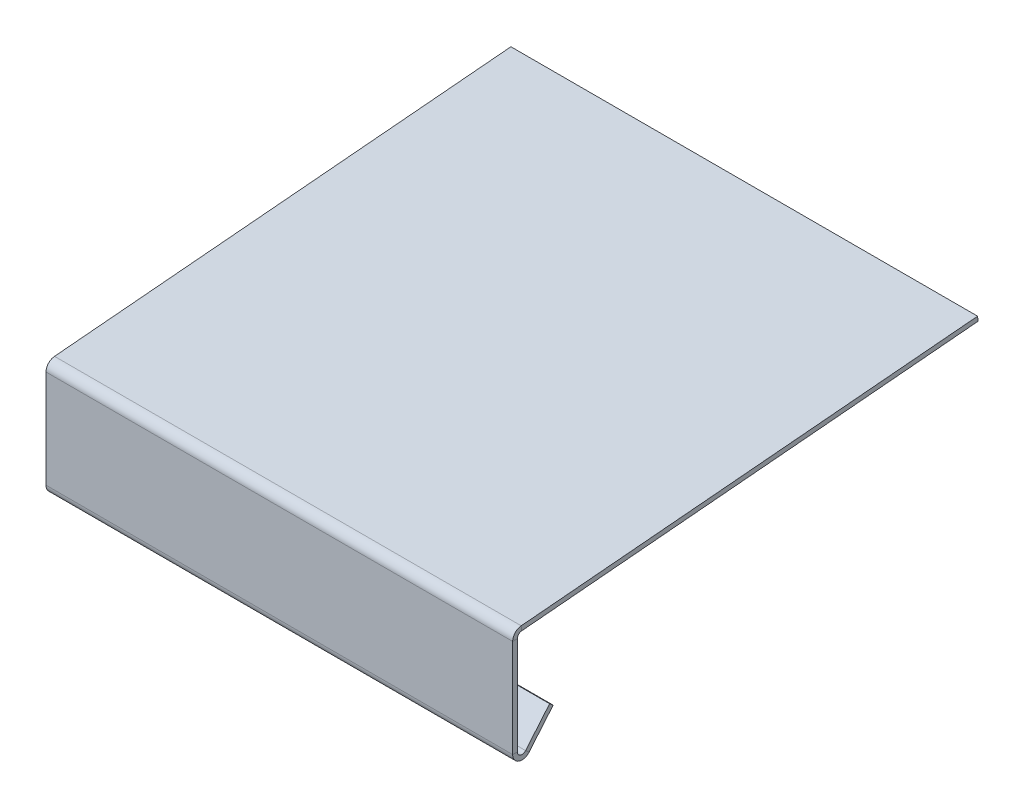
ISO-10303-21;
HEADER;
FILE_DESCRIPTION(('STEP AP214'),'2;1');
FILE_NAME('part.step','',(''),(''),'','','');
FILE_SCHEMA(('AUTOMOTIVE_DESIGN { 1 0 10303 214 1 1 1 1 }'));
ENDSEC;
DATA;
#1=APPLICATION_CONTEXT('core data for automotive mechanical design processes');
#2=APPLICATION_PROTOCOL_DEFINITION('international standard','automotive_design',2000,#1);
#3=PRODUCT_CONTEXT('',#1,'mechanical');
#4=PRODUCT('Part','Part','',(#3));
#5=PRODUCT_RELATED_PRODUCT_CATEGORY('part','',(#4));
#6=PRODUCT_DEFINITION_FORMATION('','',#4);
#7=PRODUCT_DEFINITION_CONTEXT('part definition',#1,'design');
#8=PRODUCT_DEFINITION('design','',#6,#7);
#9=PRODUCT_DEFINITION_SHAPE('','',#8);
#10=(LENGTH_UNIT() NAMED_UNIT(*) SI_UNIT(.MILLI.,.METRE.));
#11=(NAMED_UNIT(*) PLANE_ANGLE_UNIT() SI_UNIT($,.RADIAN.));
#12=(NAMED_UNIT(*) SI_UNIT($,.STERADIAN.) SOLID_ANGLE_UNIT());
#13=UNCERTAINTY_MEASURE_WITH_UNIT(LENGTH_MEASURE(1.E-05),#10,'distance_accuracy_value','');
#14=(GEOMETRIC_REPRESENTATION_CONTEXT(3) GLOBAL_UNCERTAINTY_ASSIGNED_CONTEXT((#13)) GLOBAL_UNIT_ASSIGNED_CONTEXT((#10,
#11,#12)) REPRESENTATION_CONTEXT('',''));
#15=CARTESIAN_POINT('',(0.,0.,0.));
#16=DIRECTION('',(0.,0.,1.));
#17=DIRECTION('',(1.,0.,0.));
#18=AXIS2_PLACEMENT_3D('',#15,#16,#17);
#19=CARTESIAN_POINT('',(100.,0.159727048148638,-1.82568851450469));
#20=DIRECTION('',(1.,0.,0.));
#21=DIRECTION('',(0.,0.,-1.));
#22=AXIS2_PLACEMENT_3D('',#19,#20,#21);
#23=PLANE('',#22);
#24=DIRECTION('',(0.,-0.996194698091746,-0.087155742747655));
#25=VECTOR('',#24,1.);
#26=CARTESIAN_POINT('',(100.,0.159727048148638,-1.82568851450469));
#27=LINE('',#26,#25);
#28=CARTESIAN_POINT('',(100.,0.159727048148638,-1.82568851450469));
#29=VERTEX_POINT('',#28);
#30=CARTESIAN_POINT('',(100.,-0.836467649943106,-1.91284425725235));
#31=VERTEX_POINT('',#30);
#32=EDGE_CURVE('E11',#29,#31,#27,.T.);
#33=ORIENTED_EDGE('',*,*,#32,.F.);
#34=CARTESIAN_POINT('',(100.,-1.83266234803485,-2.));
#35=DIRECTION('',(1.,0.,0.));
#36=DIRECTION('',(0.,0.,-1.));
#37=AXIS2_PLACEMENT_3D('',#34,#35,#36);
#38=CIRCLE('',#37,2.);
#39=CARTESIAN_POINT('',(100.,-1.83266234803485,0.));
#40=VERTEX_POINT('',#39);
#41=EDGE_CURVE('E165',#29,#40,#38,.T.);
#42=ORIENTED_EDGE('',*,*,#41,.T.);
#43=DIRECTION('',(0.,0.,1.));
#44=VECTOR('',#43,1.);
#45=CARTESIAN_POINT('',(100.,-1.83266234803485,-1.));
#46=LINE('',#45,#44);
#47=CARTESIAN_POINT('',(100.,-1.83266234803485,-1.));
#48=VERTEX_POINT('',#47);
#49=EDGE_CURVE('E51',#48,#40,#46,.T.);
#50=ORIENTED_EDGE('',*,*,#49,.F.);
#51=CARTESIAN_POINT('',(100.,-1.83266234803485,-2.));
#52=DIRECTION('',(1.,0.,0.));
#53=DIRECTION('',(0.,0.,-1.));
#54=AXIS2_PLACEMENT_3D('',#51,#52,#53);
#55=CIRCLE('',#54,1.);
#56=EDGE_CURVE('E279',#31,#48,#55,.T.);
#57=ORIENTED_EDGE('',*,*,#56,.F.);
#58=EDGE_LOOP('',(#33,#42,#50,#57));
#59=FACE_BOUND('',#58,.T.);
#60=ADVANCED_FACE('F43',(#59),#23,.T.);
#61=CARTESIAN_POINT('',(100.,-1.83266234803485,-1.));
#62=DIRECTION('',(1.,0.,0.));
#63=DIRECTION('',(0.,0.,-1.));
#64=AXIS2_PLACEMENT_3D('',#61,#62,#63);
#65=PLANE('',#64);
#66=DIRECTION('',(0.,-0.087155742747655,0.996194698091746));
#67=VECTOR('',#66,1.);
#68=CARTESIAN_POINT('',(100.,8.7155742747655,-99.6194698091746));
#69=LINE('',#68,#67);
#70=CARTESIAN_POINT('',(100.,8.7155742747655,-99.6194698091746));
#71=VERTEX_POINT('',#70);
#72=EDGE_CURVE('E170',#71,#29,#69,.T.);
#73=ORIENTED_EDGE('',*,*,#72,.T.);
#74=ORIENTED_EDGE('',*,*,#32,.T.);
#75=DIRECTION('',(0.,-0.087155742747655,0.996194698091746));
#76=VECTOR('',#75,1.);
#77=CARTESIAN_POINT('',(100.,7.71937957667375,-99.7066255519222));
#78=LINE('',#77,#76);
#79=CARTESIAN_POINT('',(100.,7.71937957667375,-99.7066255519222));
#80=VERTEX_POINT('',#79);
#81=EDGE_CURVE('E292',#80,#31,#78,.T.);
#82=ORIENTED_EDGE('',*,*,#81,.F.);
#83=DIRECTION('',(0.,-0.996194698091745,-0.0871557427476605));
#84=VECTOR('',#83,1.);
#85=CARTESIAN_POINT('',(100.,8.7155742747655,-99.6194698091746));
#86=LINE('',#85,#84);
#87=EDGE_CURVE('E294',#71,#80,#86,.T.);
#88=ORIENTED_EDGE('',*,*,#87,.F.);
#89=EDGE_LOOP('',(#73,#74,#82,#88));
#90=FACE_BOUND('',#89,.T.);
#91=ADVANCED_FACE('F305',(#90),#65,.T.);
#92=CARTESIAN_POINT('',(0.,-1.83266234803485,0.));
#93=DIRECTION('',(-1.,0.,0.));
#94=DIRECTION('',(0.,0.,1.));
#95=AXIS2_PLACEMENT_3D('',#92,#93,#94);
#96=PLANE('',#95);
#97=DIRECTION('',(0.,0.,-1.));
#98=VECTOR('',#97,1.);
#99=CARTESIAN_POINT('',(0.,-1.83266234803485,0.));
#100=LINE('',#99,#98);
#101=CARTESIAN_POINT('',(0.,-1.83266234803485,0.));
#102=VERTEX_POINT('',#101);
#103=CARTESIAN_POINT('',(0.,-1.83266234803485,-1.));
#104=VERTEX_POINT('',#103);
#105=EDGE_CURVE('E163',#102,#104,#100,.T.);
#106=ORIENTED_EDGE('',*,*,#105,.F.);
#107=CARTESIAN_POINT('',(0.,-1.83266234803485,-2.));
#108=DIRECTION('',(1.,0.,0.));
#109=DIRECTION('',(0.,0.,-1.));
#110=AXIS2_PLACEMENT_3D('',#107,#108,#109);
#111=CIRCLE('',#110,2.);
#112=CARTESIAN_POINT('',(0.,0.159727048148638,-1.82568851450469));
#113=VERTEX_POINT('',#112);
#114=EDGE_CURVE('E177',#113,#102,#111,.T.);
#115=ORIENTED_EDGE('',*,*,#114,.F.);
#116=DIRECTION('',(0.,0.996194698091746,0.087155742747655));
#117=VECTOR('',#116,1.);
#118=CARTESIAN_POINT('',(0.,-0.836467649943106,-1.91284425725235));
#119=LINE('',#118,#117);
#120=CARTESIAN_POINT('',(0.,-0.836467649943106,-1.91284425725235));
#121=VERTEX_POINT('',#120);
#122=EDGE_CURVE('E270',#121,#113,#119,.T.);
#123=ORIENTED_EDGE('',*,*,#122,.F.);
#124=CARTESIAN_POINT('',(0.,-1.83266234803485,-2.));
#125=DIRECTION('',(1.,0.,0.));
#126=DIRECTION('',(0.,0.,-1.));
#127=AXIS2_PLACEMENT_3D('',#124,#125,#126);
#128=CIRCLE('',#127,1.);
#129=EDGE_CURVE('E213',#121,#104,#128,.T.);
#130=ORIENTED_EDGE('',*,*,#129,.T.);
#131=EDGE_LOOP('',(#106,#115,#123,#130));
#132=FACE_BOUND('',#131,.T.);
#133=ADVANCED_FACE('F284',(#132),#96,.T.);
#134=CARTESIAN_POINT('',(0.,-0.836467649943106,-1.91284425725235));
#135=DIRECTION('',(-1.,0.,0.));
#136=DIRECTION('',(0.,0.,1.));
#137=AXIS2_PLACEMENT_3D('',#134,#135,#136);
#138=PLANE('',#137);
#139=DIRECTION('',(0.,-1.,0.));
#140=VECTOR('',#139,1.);
#141=CARTESIAN_POINT('',(0.,-1.83266234803485,0.));
#142=LINE('',#141,#140);
#143=CARTESIAN_POINT('',(0.,-22.8326623480349,0.));
#144=VERTEX_POINT('',#143);
#145=EDGE_CURVE('E226',#102,#144,#142,.T.);
#146=ORIENTED_EDGE('',*,*,#145,.F.);
#147=ORIENTED_EDGE('',*,*,#105,.T.);
#148=DIRECTION('',(0.,-1.,0.));
#149=VECTOR('',#148,1.);
#150=CARTESIAN_POINT('',(0.,-1.83266234803485,-1.));
#151=LINE('',#150,#149);
#152=CARTESIAN_POINT('',(0.,-22.8326623480349,-1.));
#153=VERTEX_POINT('',#152);
#154=EDGE_CURVE('E210',#104,#153,#151,.T.);
#155=ORIENTED_EDGE('',*,*,#154,.T.);
#156=DIRECTION('',(0.,0.,1.));
#157=VECTOR('',#156,1.);
#158=CARTESIAN_POINT('',(0.,-22.8326623480349,-1.));
#159=LINE('',#158,#157);
#160=EDGE_CURVE('E108',#153,#144,#159,.T.);
#161=ORIENTED_EDGE('',*,*,#160,.T.);
#162=EDGE_LOOP('',(#146,#147,#155,#161));
#163=FACE_BOUND('',#162,.T.);
#164=ADVANCED_FACE('F272',(#163),#138,.T.);
#165=CARTESIAN_POINT('',(100.,-22.8326623480349,0.));
#166=DIRECTION('',(1.,0.,0.));
#167=DIRECTION('',(0.,0.,-1.));
#168=AXIS2_PLACEMENT_3D('',#165,#166,#167);
#169=PLANE('',#168);
#170=DIRECTION('',(0.,0.,-1.));
#171=VECTOR('',#170,1.);
#172=CARTESIAN_POINT('',(100.,-22.8326623480349,0.));
#173=LINE('',#172,#171);
#174=CARTESIAN_POINT('',(100.,-22.8326623480349,0.));
#175=VERTEX_POINT('',#174);
#176=CARTESIAN_POINT('',(100.,-22.8326623480349,-1.));
#177=VERTEX_POINT('',#176);
#178=EDGE_CURVE('E268',#175,#177,#173,.T.);
#179=ORIENTED_EDGE('',*,*,#178,.F.);
#180=CARTESIAN_POINT('',(100.,-22.8326623480349,-2.));
#181=DIRECTION('',(1.,0.,0.));
#182=DIRECTION('',(0.,0.,-1.));
#183=AXIS2_PLACEMENT_3D('',#180,#181,#182);
#184=CIRCLE('',#183,2.);
#185=CARTESIAN_POINT('',(100.,-24.1182375674079,-3.53208888623797));
#186=VERTEX_POINT('',#185);
#187=EDGE_CURVE('E186',#175,#186,#184,.T.);
#188=ORIENTED_EDGE('',*,*,#187,.T.);
#189=DIRECTION('',(0.,-0.642787609686534,-0.766044443118982));
#190=VECTOR('',#189,1.);
#191=CARTESIAN_POINT('',(100.,-23.4754499577214,-2.76604444311899));
#192=LINE('',#191,#190);
#193=CARTESIAN_POINT('',(100.,-23.4754499577214,-2.76604444311899));
#194=VERTEX_POINT('',#193);
#195=EDGE_CURVE('E62',#194,#186,#192,.T.);
#196=ORIENTED_EDGE('',*,*,#195,.F.);
#197=CARTESIAN_POINT('',(100.,-22.8326623480349,-2.));
#198=DIRECTION('',(1.,0.,0.));
#199=DIRECTION('',(0.,0.,-1.));
#200=AXIS2_PLACEMENT_3D('',#197,#198,#199);
#201=CIRCLE('',#200,1.);
#202=EDGE_CURVE('E296',#177,#194,#201,.T.);
#203=ORIENTED_EDGE('',*,*,#202,.F.);
#204=EDGE_LOOP('',(#179,#188,#196,#203));
#205=FACE_BOUND('',#204,.T.);
#206=ADVANCED_FACE('F331',(#205),#169,.T.);
#207=CARTESIAN_POINT('',(100.,-23.4754499577214,-2.76604444311899));
#208=DIRECTION('',(1.,0.,0.));
#209=DIRECTION('',(0.,0.,-1.));
#210=AXIS2_PLACEMENT_3D('',#207,#208,#209);
#211=PLANE('',#210);
#212=DIRECTION('',(0.,-1.,0.));
#213=VECTOR('',#212,1.);
#214=CARTESIAN_POINT('',(100.,-1.83266234803485,0.));
#215=LINE('',#214,#213);
#216=EDGE_CURVE('E155',#40,#175,#215,.T.);
#217=ORIENTED_EDGE('',*,*,#216,.T.);
#218=ORIENTED_EDGE('',*,*,#178,.T.);
#219=DIRECTION('',(0.,-1.,0.));
#220=VECTOR('',#219,1.);
#221=CARTESIAN_POINT('',(100.,-1.83266234803485,-1.));
#222=LINE('',#221,#220);
#223=EDGE_CURVE('E158',#48,#177,#222,.T.);
#224=ORIENTED_EDGE('',*,*,#223,.F.);
#225=ORIENTED_EDGE('',*,*,#49,.T.);
#226=EDGE_LOOP('',(#217,#218,#224,#225));
#227=FACE_BOUND('',#226,.T.);
#228=ADVANCED_FACE('F153',(#227),#211,.T.);
#229=CARTESIAN_POINT('',(0.,-24.1182375674079,-3.53208888623797));
#230=DIRECTION('',(-1.,0.,0.));
#231=DIRECTION('',(0.,0.,1.));
#232=AXIS2_PLACEMENT_3D('',#229,#230,#231);
#233=PLANE('',#232);
#234=DIRECTION('',(0.,0.642787609686534,0.766044443118982));
#235=VECTOR('',#234,1.);
#236=CARTESIAN_POINT('',(0.,-24.1182375674079,-3.53208888623797));
#237=LINE('',#236,#235);
#238=CARTESIAN_POINT('',(0.,-24.1182375674079,-3.53208888623797));
#239=VERTEX_POINT('',#238);
#240=CARTESIAN_POINT('',(0.,-23.4754499577214,-2.76604444311899));
#241=VERTEX_POINT('',#240);
#242=EDGE_CURVE('E116',#239,#241,#237,.T.);
#243=ORIENTED_EDGE('',*,*,#242,.F.);
#244=CARTESIAN_POINT('',(0.,-22.8326623480349,-2.));
#245=DIRECTION('',(1.,0.,0.));
#246=DIRECTION('',(0.,0.,-1.));
#247=AXIS2_PLACEMENT_3D('',#244,#245,#246);
#248=CIRCLE('',#247,2.);
#249=EDGE_CURVE('E229',#144,#239,#248,.T.);
#250=ORIENTED_EDGE('',*,*,#249,.F.);
#251=ORIENTED_EDGE('',*,*,#160,.F.);
#252=CARTESIAN_POINT('',(0.,-22.8326623480349,-2.));
#253=DIRECTION('',(1.,0.,0.));
#254=DIRECTION('',(0.,0.,-1.));
#255=AXIS2_PLACEMENT_3D('',#252,#253,#254);
#256=CIRCLE('',#255,1.);
#257=EDGE_CURVE('E207',#153,#241,#256,.T.);
#258=ORIENTED_EDGE('',*,*,#257,.T.);
#259=EDGE_LOOP('',(#243,#250,#251,#258));
#260=FACE_BOUND('',#259,.T.);
#261=ADVANCED_FACE('F337',(#260),#233,.T.);
#262=CARTESIAN_POINT('',(0.,-22.8326623480349,-1.));
#263=DIRECTION('',(-1.,0.,0.));
#264=DIRECTION('',(0.,0.,1.));
#265=AXIS2_PLACEMENT_3D('',#262,#263,#264);
#266=PLANE('',#265);
#267=DIRECTION('',(0.,0.766044443118982,-0.642787609686534));
#268=VECTOR('',#267,1.);
#269=CARTESIAN_POINT('',(0.,-24.1182375674079,-3.53208888623797));
#270=LINE('',#269,#268);
#271=CARTESIAN_POINT('',(0.,-17.9898820224561,-8.67438976373024));
#272=VERTEX_POINT('',#271);
#273=EDGE_CURVE('E195',#239,#272,#270,.T.);
#274=ORIENTED_EDGE('',*,*,#273,.F.);
#275=ORIENTED_EDGE('',*,*,#242,.T.);
#276=DIRECTION('',(0.,0.766044443118982,-0.642787609686534));
#277=VECTOR('',#276,1.);
#278=CARTESIAN_POINT('',(0.,-23.4754499577214,-2.76604444311899));
#279=LINE('',#278,#277);
#280=CARTESIAN_POINT('',(0.,-17.3470944127695,-7.90834532061126));
#281=VERTEX_POINT('',#280);
#282=EDGE_CURVE('E203',#241,#281,#279,.T.);
#283=ORIENTED_EDGE('',*,*,#282,.T.);
#284=DIRECTION('',(0.,-0.642787609686533,-0.766044443118983));
#285=VECTOR('',#284,1.);
#286=CARTESIAN_POINT('',(0.,-17.3470944127695,-7.90834532061126));
#287=LINE('',#286,#285);
#288=EDGE_CURVE('E199',#281,#272,#287,.T.);
#289=ORIENTED_EDGE('',*,*,#288,.T.);
#290=EDGE_LOOP('',(#274,#275,#283,#289));
#291=FACE_BOUND('',#290,.T.);
#292=ADVANCED_FACE('F340',(#291),#266,.T.);
#293=CARTESIAN_POINT('',(100.,-24.1182375674079,-3.53208888623797));
#294=DIRECTION('',(0.,0.642787609686534,0.766044443118983));
#295=DIRECTION('',(0.,-0.766044443118982,0.642787609686534));
#296=AXIS2_PLACEMENT_3D('',#293,#294,#295);
#297=PLANE('',#296);
#298=ORIENTED_EDGE('',*,*,#273,.T.);
#299=DIRECTION('',(-1.,0.,0.));
#300=VECTOR('',#299,1.);
#301=CARTESIAN_POINT('',(100.,-17.9898820224561,-8.67438976373024));
#302=LINE('',#301,#300);
#303=CARTESIAN_POINT('',(100.,-17.9898820224561,-8.67438976373024));
#304=VERTEX_POINT('',#303);
#305=EDGE_CURVE('E259',#304,#272,#302,.T.);
#306=ORIENTED_EDGE('',*,*,#305,.F.);
#307=DIRECTION('',(0.,0.766044443118982,-0.642787609686534));
#308=VECTOR('',#307,1.);
#309=CARTESIAN_POINT('',(100.,-24.1182375674079,-3.53208888623797));
#310=LINE('',#309,#308);
#311=EDGE_CURVE('E124',#186,#304,#310,.T.);
#312=ORIENTED_EDGE('',*,*,#311,.F.);
#313=DIRECTION('',(-1.,0.,0.));
#314=VECTOR('',#313,1.);
#315=CARTESIAN_POINT('',(100.,-24.1182375674079,-3.53208888623797));
#316=LINE('',#315,#314);
#317=EDGE_CURVE('E191',#186,#239,#316,.T.);
#318=ORIENTED_EDGE('',*,*,#317,.T.);
#319=EDGE_LOOP('',(#298,#306,#312,#318));
#320=FACE_BOUND('',#319,.T.);
#321=ADVANCED_FACE('F343',(#320),#297,.F.);
#322=CARTESIAN_POINT('',(100.,-17.3470944127695,-7.90834532061126));
#323=DIRECTION('',(0.,0.766044443118983,-0.642787609686533));
#324=DIRECTION('',(0.,0.642787609686533,0.766044443118983));
#325=AXIS2_PLACEMENT_3D('',#322,#323,#324);
#326=PLANE('',#325);
#327=ORIENTED_EDGE('',*,*,#288,.F.);
#328=DIRECTION('',(-1.,0.,0.));
#329=VECTOR('',#328,1.);
#330=CARTESIAN_POINT('',(100.,-17.3470944127695,-7.90834532061126));
#331=LINE('',#330,#329);
#332=CARTESIAN_POINT('',(100.,-17.3470944127695,-7.90834532061126));
#333=VERTEX_POINT('',#332);
#334=EDGE_CURVE('E256',#333,#281,#331,.T.);
#335=ORIENTED_EDGE('',*,*,#334,.F.);
#336=DIRECTION('',(0.,-0.642787609686533,-0.766044443118983));
#337=VECTOR('',#336,1.);
#338=CARTESIAN_POINT('',(100.,-17.3470944127695,-7.90834532061126));
#339=LINE('',#338,#337);
#340=EDGE_CURVE('E551',#333,#304,#339,.T.);
#341=ORIENTED_EDGE('',*,*,#340,.T.);
#342=ORIENTED_EDGE('',*,*,#305,.T.);
#343=EDGE_LOOP('',(#327,#335,#341,#342));
#344=FACE_BOUND('',#343,.T.);
#345=ADVANCED_FACE('F347',(#344),#326,.T.);
#346=CARTESIAN_POINT('',(100.,-23.4754499577214,-2.76604444311899));
#347=DIRECTION('',(0.,0.642787609686534,0.766044443118983));
#348=DIRECTION('',(0.,-0.766044443118982,0.642787609686534));
#349=AXIS2_PLACEMENT_3D('',#346,#347,#348);
#350=PLANE('',#349);
#351=ORIENTED_EDGE('',*,*,#282,.F.);
#352=DIRECTION('',(-1.,0.,0.));
#353=VECTOR('',#352,1.);
#354=CARTESIAN_POINT('',(100.,-23.4754499577214,-2.76604444311899));
#355=LINE('',#354,#353);
#356=EDGE_CURVE('E252',#194,#241,#355,.T.);
#357=ORIENTED_EDGE('',*,*,#356,.F.);
#358=DIRECTION('',(0.,0.766044443118982,-0.642787609686534));
#359=VECTOR('',#358,1.);
#360=CARTESIAN_POINT('',(100.,-23.4754499577214,-2.76604444311899));
#361=LINE('',#360,#359);
#362=EDGE_CURVE('E554',#194,#333,#361,.T.);
#363=ORIENTED_EDGE('',*,*,#362,.T.);
#364=ORIENTED_EDGE('',*,*,#334,.T.);
#365=EDGE_LOOP('',(#351,#357,#363,#364));
#366=FACE_BOUND('',#365,.T.);
#367=ADVANCED_FACE('F351',(#366),#350,.T.);
#368=CARTESIAN_POINT('',(100.,-22.8326623480349,-2.));
#369=DIRECTION('',(-1.,0.,0.));
#370=DIRECTION('',(0.,0.,1.));
#371=AXIS2_PLACEMENT_3D('',#368,#369,#370);
#372=CYLINDRICAL_SURFACE('',#371,1.);
#373=ORIENTED_EDGE('',*,*,#257,.F.);
#374=DIRECTION('',(-1.,0.,0.));
#375=VECTOR('',#374,1.);
#376=CARTESIAN_POINT('',(100.,-22.8326623480349,-1.));
#377=LINE('',#376,#375);
#378=EDGE_CURVE('E248',#177,#153,#377,.T.);
#379=ORIENTED_EDGE('',*,*,#378,.F.);
#380=ORIENTED_EDGE('',*,*,#202,.T.);
#381=ORIENTED_EDGE('',*,*,#356,.T.);
#382=EDGE_LOOP('',(#373,#379,#380,#381));
#383=FACE_BOUND('',#382,.T.);
#384=ADVANCED_FACE('F355',(#383),#372,.F.);
#385=CARTESIAN_POINT('',(100.,-1.83266234803485,-1.));
#386=DIRECTION('',(0.,0.,-1.));
#387=DIRECTION('',(0.,1.,0.));
#388=AXIS2_PLACEMENT_3D('',#385,#386,#387);
#389=PLANE('',#388);
#390=ORIENTED_EDGE('',*,*,#154,.F.);
#391=DIRECTION('',(-1.,0.,0.));
#392=VECTOR('',#391,1.);
#393=CARTESIAN_POINT('',(100.,-1.83266234803485,-1.));
#394=LINE('',#393,#392);
#395=EDGE_CURVE('E245',#48,#104,#394,.T.);
#396=ORIENTED_EDGE('',*,*,#395,.F.);
#397=ORIENTED_EDGE('',*,*,#223,.T.);
#398=ORIENTED_EDGE('',*,*,#378,.T.);
#399=EDGE_LOOP('',(#390,#396,#397,#398));
#400=FACE_BOUND('',#399,.T.);
#401=ADVANCED_FACE('F281',(#400),#389,.T.);
#402=CARTESIAN_POINT('',(100.,-1.83266234803485,-2.));
#403=DIRECTION('',(-1.,0.,0.));
#404=DIRECTION('',(0.,0.,1.));
#405=AXIS2_PLACEMENT_3D('',#402,#403,#404);
#406=CYLINDRICAL_SURFACE('',#405,1.);
#407=ORIENTED_EDGE('',*,*,#129,.F.);
#408=DIRECTION('',(-1.,0.,0.));
#409=VECTOR('',#408,1.);
#410=CARTESIAN_POINT('',(100.,-0.836467649943106,-1.91284425725235));
#411=LINE('',#410,#409);
#412=EDGE_CURVE('E242',#31,#121,#411,.T.);
#413=ORIENTED_EDGE('',*,*,#412,.F.);
#414=ORIENTED_EDGE('',*,*,#56,.T.);
#415=ORIENTED_EDGE('',*,*,#395,.T.);
#416=EDGE_LOOP('',(#407,#413,#414,#415));
#417=FACE_BOUND('',#416,.T.);
#418=ADVANCED_FACE('F277',(#417),#406,.F.);
#419=CARTESIAN_POINT('',(100.,7.71937957667375,-99.7066255519222));
#420=DIRECTION('',(0.,-0.996194698091746,-0.087155742747655));
#421=DIRECTION('',(0.,0.087155742747655,-0.996194698091746));
#422=AXIS2_PLACEMENT_3D('',#419,#420,#421);
#423=PLANE('',#422);
#424=DIRECTION('',(0.,-0.087155742747655,0.996194698091746));
#425=VECTOR('',#424,1.);
#426=CARTESIAN_POINT('',(0.,7.71937957667375,-99.7066255519222));
#427=LINE('',#426,#425);
#428=CARTESIAN_POINT('',(0.,7.71937957667375,-99.7066255519222));
#429=VERTEX_POINT('',#428);
#430=EDGE_CURVE('E216',#429,#121,#427,.T.);
#431=ORIENTED_EDGE('',*,*,#430,.F.);
#432=DIRECTION('',(-1.,0.,0.));
#433=VECTOR('',#432,1.);
#434=CARTESIAN_POINT('',(100.,7.71937957667375,-99.7066255519222));
#435=LINE('',#434,#433);
#436=EDGE_CURVE('E240',#80,#429,#435,.T.);
#437=ORIENTED_EDGE('',*,*,#436,.F.);
#438=ORIENTED_EDGE('',*,*,#81,.T.);
#439=ORIENTED_EDGE('',*,*,#412,.T.);
#440=EDGE_LOOP('',(#431,#437,#438,#439));
#441=FACE_BOUND('',#440,.T.);
#442=ADVANCED_FACE('F290',(#441),#423,.T.);
#443=CARTESIAN_POINT('',(100.,8.7155742747655,-99.6194698091746));
#444=DIRECTION('',(0.,0.0871557427476605,-0.996194698091745));
#445=DIRECTION('',(0.,0.996194698091745,0.0871557427476605));
#446=AXIS2_PLACEMENT_3D('',#443,#444,#445);
#447=PLANE('',#446);
#448=DIRECTION('',(0.,-0.996194698091745,-0.0871557427476605));
#449=VECTOR('',#448,1.);
#450=CARTESIAN_POINT('',(0.,8.7155742747655,-99.6194698091746));
#451=LINE('',#450,#449);
#452=CARTESIAN_POINT('',(0.,8.7155742747655,-99.6194698091746));
#453=VERTEX_POINT('',#452);
#454=EDGE_CURVE('E219',#453,#429,#451,.T.);
#455=ORIENTED_EDGE('',*,*,#454,.F.);
#456=DIRECTION('',(-1.,0.,0.));
#457=VECTOR('',#456,1.);
#458=CARTESIAN_POINT('',(100.,8.7155742747655,-99.6194698091746));
#459=LINE('',#458,#457);
#460=EDGE_CURVE('E238',#71,#453,#459,.T.);
#461=ORIENTED_EDGE('',*,*,#460,.F.);
#462=ORIENTED_EDGE('',*,*,#87,.T.);
#463=ORIENTED_EDGE('',*,*,#436,.T.);
#464=EDGE_LOOP('',(#455,#461,#462,#463));
#465=FACE_BOUND('',#464,.T.);
#466=ADVANCED_FACE('F311',(#465),#447,.T.);
#467=CARTESIAN_POINT('',(100.,8.7155742747655,-99.6194698091746));
#468=DIRECTION('',(0.,-0.996194698091746,-0.087155742747655));
#469=DIRECTION('',(0.,0.087155742747655,-0.996194698091746));
#470=AXIS2_PLACEMENT_3D('',#467,#468,#469);
#471=PLANE('',#470);
#472=DIRECTION('',(0.,-0.087155742747655,0.996194698091746));
#473=VECTOR('',#472,1.);
#474=CARTESIAN_POINT('',(0.,8.7155742747655,-99.6194698091746));
#475=LINE('',#474,#473);
#476=EDGE_CURVE('E222',#453,#113,#475,.T.);
#477=ORIENTED_EDGE('',*,*,#476,.T.);
#478=DIRECTION('',(-1.,0.,0.));
#479=VECTOR('',#478,1.);
#480=CARTESIAN_POINT('',(100.,0.159727048148638,-1.82568851450469));
#481=LINE('',#480,#479);
#482=EDGE_CURVE('E179',#29,#113,#481,.T.);
#483=ORIENTED_EDGE('',*,*,#482,.F.);
#484=ORIENTED_EDGE('',*,*,#72,.F.);
#485=ORIENTED_EDGE('',*,*,#460,.T.);
#486=EDGE_LOOP('',(#477,#483,#484,#485));
#487=FACE_BOUND('',#486,.T.);
#488=ADVANCED_FACE('F307',(#487),#471,.F.);
#489=CARTESIAN_POINT('',(100.,-1.83266234803485,-2.));
#490=DIRECTION('',(-1.,0.,0.));
#491=DIRECTION('',(0.,0.,1.));
#492=AXIS2_PLACEMENT_3D('',#489,#490,#491);
#493=CYLINDRICAL_SURFACE('',#492,2.);
#494=ORIENTED_EDGE('',*,*,#114,.T.);
#495=DIRECTION('',(-1.,0.,0.));
#496=VECTOR('',#495,1.);
#497=CARTESIAN_POINT('',(100.,-1.83266234803485,0.));
#498=LINE('',#497,#496);
#499=EDGE_CURVE('E174',#40,#102,#498,.T.);
#500=ORIENTED_EDGE('',*,*,#499,.F.);
#501=ORIENTED_EDGE('',*,*,#41,.F.);
#502=ORIENTED_EDGE('',*,*,#482,.T.);
#503=EDGE_LOOP('',(#494,#500,#501,#502));
#504=FACE_BOUND('',#503,.T.);
#505=ADVANCED_FACE('F175',(#504),#493,.T.);
#506=CARTESIAN_POINT('',(100.,-1.83266234803485,0.));
#507=DIRECTION('',(0.,0.,-1.));
#508=DIRECTION('',(0.,1.,0.));
#509=AXIS2_PLACEMENT_3D('',#506,#507,#508);
#510=PLANE('',#509);
#511=ORIENTED_EDGE('',*,*,#145,.T.);
#512=DIRECTION('',(-1.,0.,0.));
#513=VECTOR('',#512,1.);
#514=CARTESIAN_POINT('',(100.,-22.8326623480349,0.));
#515=LINE('',#514,#513);
#516=EDGE_CURVE('E180',#175,#144,#515,.T.);
#517=ORIENTED_EDGE('',*,*,#516,.F.);
#518=ORIENTED_EDGE('',*,*,#216,.F.);
#519=ORIENTED_EDGE('',*,*,#499,.T.);
#520=EDGE_LOOP('',(#511,#517,#518,#519));
#521=FACE_BOUND('',#520,.T.);
#522=ADVANCED_FACE('F182',(#521),#510,.F.);
#523=CARTESIAN_POINT('',(100.,-22.8326623480349,-2.));
#524=DIRECTION('',(-1.,0.,0.));
#525=DIRECTION('',(0.,0.,1.));
#526=AXIS2_PLACEMENT_3D('',#523,#524,#525);
#527=CYLINDRICAL_SURFACE('',#526,2.);
#528=ORIENTED_EDGE('',*,*,#249,.T.);
#529=ORIENTED_EDGE('',*,*,#317,.F.);
#530=ORIENTED_EDGE('',*,*,#187,.F.);
#531=ORIENTED_EDGE('',*,*,#516,.T.);
#532=EDGE_LOOP('',(#528,#529,#530,#531));
#533=FACE_BOUND('',#532,.T.);
#534=ADVANCED_FACE('F402',(#533),#527,.T.);
#535=CARTESIAN_POINT('',(100.,-22.8326623480349,-2.));
#536=DIRECTION('',(1.,0.,0.));
#537=DIRECTION('',(0.,0.,-1.));
#538=AXIS2_PLACEMENT_3D('',#535,#536,#537);
#539=PLANE('',#538);
#540=ORIENTED_EDGE('',*,*,#311,.T.);
#541=ORIENTED_EDGE('',*,*,#340,.F.);
#542=ORIENTED_EDGE('',*,*,#362,.F.);
#543=ORIENTED_EDGE('',*,*,#195,.T.);
#544=EDGE_LOOP('',(#540,#541,#542,#543));
#545=FACE_BOUND('',#544,.T.);
#546=ADVANCED_FACE('F412',(#545),#539,.T.);
#547=CARTESIAN_POINT('',(0.,-22.8326623480349,-2.));
#548=DIRECTION('',(1.,0.,0.));
#549=DIRECTION('',(0.,0.,-1.));
#550=AXIS2_PLACEMENT_3D('',#547,#548,#549);
#551=PLANE('',#550);
#552=ORIENTED_EDGE('',*,*,#430,.T.);
#553=ORIENTED_EDGE('',*,*,#122,.T.);
#554=ORIENTED_EDGE('',*,*,#476,.F.);
#555=ORIENTED_EDGE('',*,*,#454,.T.);
#556=EDGE_LOOP('',(#552,#553,#554,#555));
#557=FACE_BOUND('',#556,.T.);
#558=ADVANCED_FACE('F309',(#557),#551,.F.);
#559=CLOSED_SHELL('',(#60,#91,#133,#164,#206,#228,#261,#292,#321,#345,#367,#384,#401,#418,#442,
#466,#488,#505,#522,#534,#546,#558));
#560=MANIFOLD_SOLID_BREP('B2',#559);
#561=ADVANCED_BREP_SHAPE_REPRESENTATION('',(#18,#560),#14);
#562=SHAPE_DEFINITION_REPRESENTATION(#9,#561);
ENDSEC;
END-ISO-10303-21;
